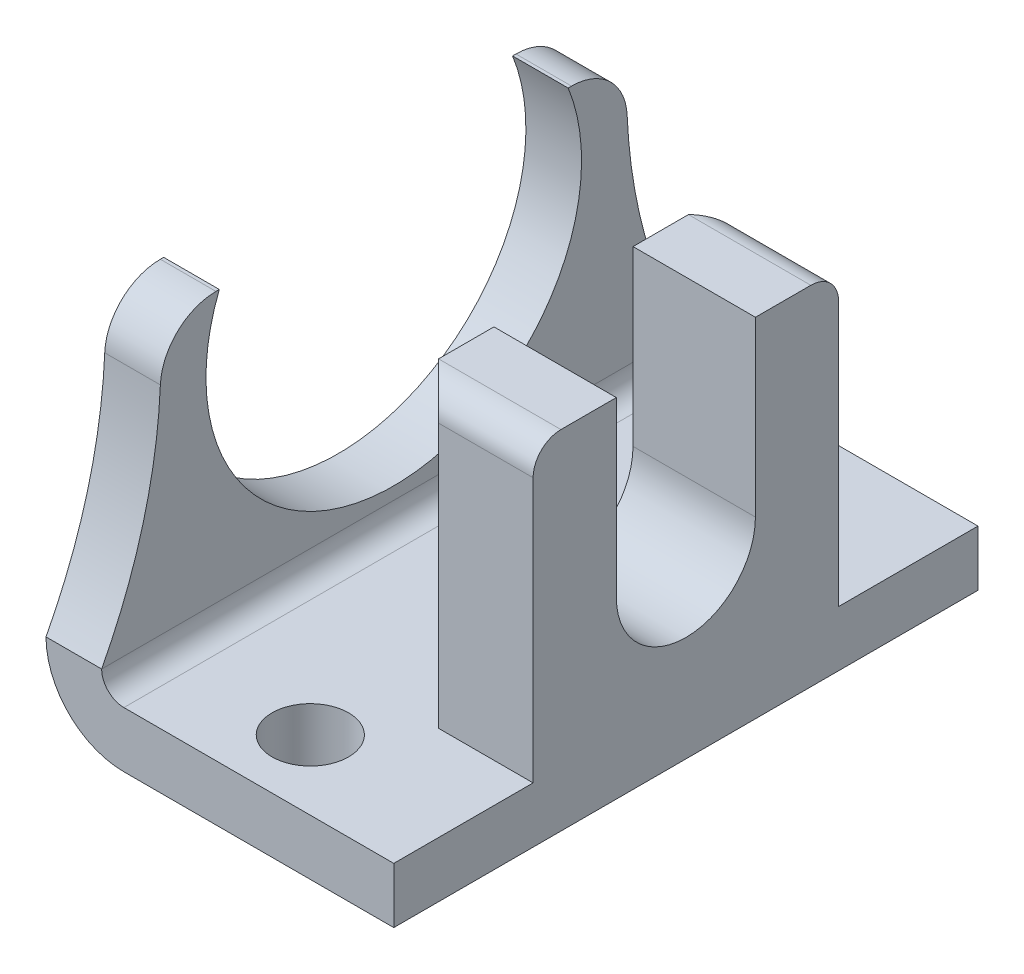
ISO-10303-21;
HEADER;
FILE_DESCRIPTION(('STEP AP214'),'2;1');
FILE_NAME('part.step','',(''),(''),'','','');
FILE_SCHEMA(('AUTOMOTIVE_DESIGN { 1 0 10303 214 1 1 1 1 }'));
ENDSEC;
DATA;
#1=APPLICATION_CONTEXT('core data for automotive mechanical design processes');
#2=APPLICATION_PROTOCOL_DEFINITION('international standard','automotive_design',2000,#1);
#3=PRODUCT_CONTEXT('',#1,'mechanical');
#4=PRODUCT('Part','Part','',(#3));
#5=PRODUCT_RELATED_PRODUCT_CATEGORY('part','',(#4));
#6=PRODUCT_DEFINITION_FORMATION('','',#4);
#7=PRODUCT_DEFINITION_CONTEXT('part definition',#1,'design');
#8=PRODUCT_DEFINITION('design','',#6,#7);
#9=PRODUCT_DEFINITION_SHAPE('','',#8);
#10=(LENGTH_UNIT() NAMED_UNIT(*) SI_UNIT(.MILLI.,.METRE.));
#11=(NAMED_UNIT(*) PLANE_ANGLE_UNIT() SI_UNIT($,.RADIAN.));
#12=(NAMED_UNIT(*) SI_UNIT($,.STERADIAN.) SOLID_ANGLE_UNIT());
#13=UNCERTAINTY_MEASURE_WITH_UNIT(LENGTH_MEASURE(1.E-05),#10,'distance_accuracy_value','');
#14=(GEOMETRIC_REPRESENTATION_CONTEXT(3) GLOBAL_UNCERTAINTY_ASSIGNED_CONTEXT((#13)) GLOBAL_UNIT_ASSIGNED_CONTEXT((#10,
#11,#12)) REPRESENTATION_CONTEXT('',''));
#15=CARTESIAN_POINT('',(0.,0.,0.));
#16=DIRECTION('',(0.,0.,1.));
#17=DIRECTION('',(1.,0.,0.));
#18=AXIS2_PLACEMENT_3D('',#15,#16,#17);
#19=CARTESIAN_POINT('',(0.,25.,-21.));
#20=DIRECTION('',(0.,1.,0.));
#21=DIRECTION('',(0.,0.,1.));
#22=AXIS2_PLACEMENT_3D('',#19,#20,#21);
#23=PLANE('',#22);
#24=DIRECTION('',(0.,0.,1.));
#25=VECTOR('',#24,1.);
#26=CARTESIAN_POINT('',(0.,25.,-21.));
#27=LINE('',#26,#25);
#28=CARTESIAN_POINT('',(0.,25.,12.5399362039845));
#29=VERTEX_POINT('',#28);
#30=CARTESIAN_POINT('',(0.,25.,12.7815482093835));
#31=VERTEX_POINT('',#30);
#32=EDGE_CURVE('E205',#29,#31,#27,.T.);
#33=ORIENTED_EDGE('',*,*,#32,.T.);
#34=DIRECTION('',(-1.,0.,0.));
#35=VECTOR('',#34,1.);
#36=CARTESIAN_POINT('',(4.,25.,12.7815482093835));
#37=LINE('',#36,#35);
#38=CARTESIAN_POINT('',(4.,25.,12.7815482093835));
#39=VERTEX_POINT('',#38);
#40=EDGE_CURVE('E369',#31,#39,#37,.F.);
#41=ORIENTED_EDGE('',*,*,#40,.T.);
#42=DIRECTION('',(0.,0.,1.));
#43=VECTOR('',#42,1.);
#44=CARTESIAN_POINT('',(4.,25.,-21.));
#45=LINE('',#44,#43);
#46=CARTESIAN_POINT('',(4.,25.,12.5399362039845));
#47=VERTEX_POINT('',#46);
#48=EDGE_CURVE('E298',#47,#39,#45,.T.);
#49=ORIENTED_EDGE('',*,*,#48,.F.);
#50=DIRECTION('',(1.,0.,0.));
#51=VECTOR('',#50,1.);
#52=CARTESIAN_POINT('',(4.,25.,12.5399362039845));
#53=LINE('',#52,#51);
#54=EDGE_CURVE('E214',#29,#47,#53,.T.);
#55=ORIENTED_EDGE('',*,*,#54,.F.);
#56=EDGE_LOOP('',(#33,#41,#49,#55));
#57=FACE_BOUND('',#56,.T.);
#58=ADVANCED_FACE('F39',(#57),#23,.T.);
#59=CARTESIAN_POINT('',(0.,25.,0.));
#60=DIRECTION('',(0.,-1.,0.));
#61=DIRECTION('',(0.,0.,-1.));
#62=AXIS2_PLACEMENT_3D('',#59,#60,#61);
#63=PLANE('',#62);
#64=DIRECTION('',(0.,0.,1.));
#65=VECTOR('',#64,1.);
#66=CARTESIAN_POINT('',(16.2,25.,10.9819738809373));
#67=LINE('',#66,#65);
#68=CARTESIAN_POINT('',(16.2,25.,5.));
#69=VERTEX_POINT('',#68);
#70=CARTESIAN_POINT('',(16.2,25.,8.98197388093732));
#71=VERTEX_POINT('',#70);
#72=EDGE_CURVE('E266',#69,#71,#67,.T.);
#73=ORIENTED_EDGE('',*,*,#72,.T.);
#74=DIRECTION('',(1.,0.,0.));
#75=VECTOR('',#74,1.);
#76=CARTESIAN_POINT('',(0.,25.,8.98197388093731));
#77=LINE('',#76,#75);
#78=CARTESIAN_POINT('',(25.,25.,8.9819738809373));
#79=VERTEX_POINT('',#78);
#80=EDGE_CURVE('E339',#71,#79,#77,.T.);
#81=ORIENTED_EDGE('',*,*,#80,.T.);
#82=DIRECTION('',(0.,0.,-1.));
#83=VECTOR('',#82,1.);
#84=CARTESIAN_POINT('',(25.,25.,-10.9819738809373));
#85=LINE('',#84,#83);
#86=CARTESIAN_POINT('',(25.,25.,5.));
#87=VERTEX_POINT('',#86);
#88=EDGE_CURVE('E267',#79,#87,#85,.T.);
#89=ORIENTED_EDGE('',*,*,#88,.T.);
#90=DIRECTION('',(1.,0.,0.));
#91=VECTOR('',#90,1.);
#92=CARTESIAN_POINT('',(-0.001000000000001,25.,5.));
#93=LINE('',#92,#91);
#94=EDGE_CURVE('E240',#69,#87,#93,.T.);
#95=ORIENTED_EDGE('',*,*,#94,.F.);
#96=EDGE_LOOP('',(#73,#81,#89,#95));
#97=FACE_BOUND('',#96,.T.);
#98=ADVANCED_FACE('F431',(#97),#63,.F.);
#99=CARTESIAN_POINT('',(4.,4.,-21.));
#100=DIRECTION('',(0.,-1.,0.));
#101=DIRECTION('',(0.,0.,-1.));
#102=AXIS2_PLACEMENT_3D('',#99,#100,#101);
#103=PLANE('',#102);
#104=CARTESIAN_POINT('',(14.,4.,16.));
#105=DIRECTION('',(0.,-1.,0.));
#106=DIRECTION('',(0.,0.,-1.));
#107=AXIS2_PLACEMENT_3D('',#104,#105,#106);
#108=CIRCLE('',#107,2.74999999999999);
#109=CARTESIAN_POINT('',(14.,4.,13.25));
#110=VERTEX_POINT('',#109);
#111=EDGE_CURVE('E513',#110,#110,#108,.T.);
#112=ORIENTED_EDGE('',*,*,#111,.T.);
#113=EDGE_LOOP('',(#112));
#114=FACE_BOUND('',#113,.T.);
#115=CARTESIAN_POINT('',(14.,4.,-16.));
#116=DIRECTION('',(0.,-1.,0.));
#117=DIRECTION('',(0.,0.,-1.));
#118=AXIS2_PLACEMENT_3D('',#115,#116,#117);
#119=CIRCLE('',#118,2.74999999999999);
#120=CARTESIAN_POINT('',(14.,4.,-18.75));
#121=VERTEX_POINT('',#120);
#122=EDGE_CURVE('E220',#121,#121,#119,.T.);
#123=ORIENTED_EDGE('',*,*,#122,.T.);
#124=EDGE_LOOP('',(#123));
#125=FACE_BOUND('',#124,.T.);
#126=DIRECTION('',(1.,0.,0.));
#127=VECTOR('',#126,1.);
#128=CARTESIAN_POINT('',(4.,4.,-21.));
#129=LINE('',#128,#127);
#130=CARTESIAN_POINT('',(5.59999999999992,4.,-21.));
#131=VERTEX_POINT('',#130);
#132=CARTESIAN_POINT('',(25.,4.,-21.));
#133=VERTEX_POINT('',#132);
#134=EDGE_CURVE('E291',#131,#133,#129,.T.);
#135=ORIENTED_EDGE('',*,*,#134,.F.);
#136=DIRECTION('',(0.,0.,1.));
#137=VECTOR('',#136,1.);
#138=CARTESIAN_POINT('',(5.59999999999992,4.,21.));
#139=LINE('',#138,#137);
#140=CARTESIAN_POINT('',(5.59999999999992,4.,21.));
#141=VERTEX_POINT('',#140);
#142=EDGE_CURVE('E329',#131,#141,#139,.T.);
#143=ORIENTED_EDGE('',*,*,#142,.T.);
#144=DIRECTION('',(1.,0.,0.));
#145=VECTOR('',#144,1.);
#146=CARTESIAN_POINT('',(4.,4.,21.));
#147=LINE('',#146,#145);
#148=CARTESIAN_POINT('',(25.,4.,21.));
#149=VERTEX_POINT('',#148);
#150=EDGE_CURVE('E290',#141,#149,#147,.T.);
#151=ORIENTED_EDGE('',*,*,#150,.T.);
#152=DIRECTION('',(0.,0.,1.));
#153=VECTOR('',#152,1.);
#154=CARTESIAN_POINT('',(25.,4.,-21.));
#155=LINE('',#154,#153);
#156=CARTESIAN_POINT('',(25.,4.,10.9819738809373));
#157=VERTEX_POINT('',#156);
#158=EDGE_CURVE('E293',#157,#149,#155,.T.);
#159=ORIENTED_EDGE('',*,*,#158,.F.);
#160=DIRECTION('',(1.,0.,0.));
#161=VECTOR('',#160,1.);
#162=CARTESIAN_POINT('',(25.,4.,10.9819738809373));
#163=LINE('',#162,#161);
#164=CARTESIAN_POINT('',(18.2,4.,10.9819738809373));
#165=VERTEX_POINT('',#164);
#166=EDGE_CURVE('E275',#165,#157,#163,.T.);
#167=ORIENTED_EDGE('',*,*,#166,.F.);
#168=DIRECTION('',(0.707106781186545,0.,0.70710678118655));
#169=VECTOR('',#168,1.);
#170=CARTESIAN_POINT('',(-4.89098694046862,4.,-12.1090130595314));
#171=LINE('',#170,#169);
#172=CARTESIAN_POINT('',(16.2,4.,8.98197388093732));
#173=VERTEX_POINT('',#172);
#174=EDGE_CURVE('E327',#165,#173,#171,.F.);
#175=ORIENTED_EDGE('',*,*,#174,.T.);
#176=DIRECTION('',(0.,0.,1.));
#177=VECTOR('',#176,1.);
#178=CARTESIAN_POINT('',(16.2,4.,10.9819738809373));
#179=LINE('',#178,#177);
#180=CARTESIAN_POINT('',(16.2,4.,-8.98197388093732));
#181=VERTEX_POINT('',#180);
#182=EDGE_CURVE('E272',#181,#173,#179,.T.);
#183=ORIENTED_EDGE('',*,*,#182,.F.);
#184=DIRECTION('',(-0.707106781186548,0.,0.707106781186547));
#185=VECTOR('',#184,1.);
#186=CARTESIAN_POINT('',(16.1090130595313,4.,-8.89098694046865));
#187=LINE('',#186,#185);
#188=CARTESIAN_POINT('',(18.2,4.,-10.9819738809373));
#189=VERTEX_POINT('',#188);
#190=EDGE_CURVE('E325',#181,#189,#187,.F.);
#191=ORIENTED_EDGE('',*,*,#190,.T.);
#192=DIRECTION('',(-1.,0.,0.));
#193=VECTOR('',#192,1.);
#194=CARTESIAN_POINT('',(16.2,4.,-10.9819738809373));
#195=LINE('',#194,#193);
#196=CARTESIAN_POINT('',(25.,4.,-10.9819738809373));
#197=VERTEX_POINT('',#196);
#198=EDGE_CURVE('E262',#197,#189,#195,.T.);
#199=ORIENTED_EDGE('',*,*,#198,.F.);
#200=EDGE_CURVE('E299',#133,#197,#155,.T.);
#201=ORIENTED_EDGE('',*,*,#200,.F.);
#202=EDGE_LOOP('',(#135,#143,#151,#159,#167,#175,#183,#191,#199,#201));
#203=FACE_BOUND('',#202,.T.);
#204=ADVANCED_FACE('F402',(#114,#125,#203),#103,.F.);
#205=CARTESIAN_POINT('',(0.,0.,21.));
#206=DIRECTION('',(0.,-1.,0.));
#207=DIRECTION('',(0.,0.,-1.));
#208=AXIS2_PLACEMENT_3D('',#205,#206,#207);
#209=PLANE('',#208);
#210=CARTESIAN_POINT('',(14.,0.,16.));
#211=DIRECTION('',(0.,-1.,0.));
#212=DIRECTION('',(0.,0.,-1.));
#213=AXIS2_PLACEMENT_3D('',#210,#211,#212);
#214=CIRCLE('',#213,2.74999999999999);
#215=CARTESIAN_POINT('',(14.,0.,13.25));
#216=VERTEX_POINT('',#215);
#217=EDGE_CURVE('E510',#216,#216,#214,.T.);
#218=ORIENTED_EDGE('',*,*,#217,.F.);
#219=EDGE_LOOP('',(#218));
#220=FACE_BOUND('',#219,.T.);
#221=CARTESIAN_POINT('',(14.,0.,-16.));
#222=DIRECTION('',(0.,-1.,0.));
#223=DIRECTION('',(0.,0.,-1.));
#224=AXIS2_PLACEMENT_3D('',#221,#222,#223);
#225=CIRCLE('',#224,2.74999999999999);
#226=CARTESIAN_POINT('',(14.,0.,-18.75));
#227=VERTEX_POINT('',#226);
#228=EDGE_CURVE('E223',#227,#227,#225,.T.);
#229=ORIENTED_EDGE('',*,*,#228,.F.);
#230=EDGE_LOOP('',(#229));
#231=FACE_BOUND('',#230,.T.);
#232=DIRECTION('',(1.,0.,0.));
#233=VECTOR('',#232,1.);
#234=CARTESIAN_POINT('',(0.,0.,21.));
#235=LINE('',#234,#233);
#236=CARTESIAN_POINT('',(5.59999999999989,0.,21.));
#237=VERTEX_POINT('',#236);
#238=CARTESIAN_POINT('',(25.,0.,21.));
#239=VERTEX_POINT('',#238);
#240=EDGE_CURVE('E310',#237,#239,#235,.T.);
#241=ORIENTED_EDGE('',*,*,#240,.F.);
#242=DIRECTION('',(0.,0.,-1.));
#243=VECTOR('',#242,1.);
#244=CARTESIAN_POINT('',(5.59999999999989,0.,-21.));
#245=LINE('',#244,#243);
#246=CARTESIAN_POINT('',(5.59999999999989,0.,-21.));
#247=VERTEX_POINT('',#246);
#248=EDGE_CURVE('E374',#237,#247,#245,.T.);
#249=ORIENTED_EDGE('',*,*,#248,.T.);
#250=DIRECTION('',(1.,0.,0.));
#251=VECTOR('',#250,1.);
#252=CARTESIAN_POINT('',(0.,0.,-21.));
#253=LINE('',#252,#251);
#254=CARTESIAN_POINT('',(25.,0.,-21.));
#255=VERTEX_POINT('',#254);
#256=EDGE_CURVE('E204',#247,#255,#253,.T.);
#257=ORIENTED_EDGE('',*,*,#256,.T.);
#258=DIRECTION('',(0.,0.,-1.));
#259=VECTOR('',#258,1.);
#260=CARTESIAN_POINT('',(25.,0.,21.));
#261=LINE('',#260,#259);
#262=EDGE_CURVE('E297',#239,#255,#261,.T.);
#263=ORIENTED_EDGE('',*,*,#262,.F.);
#264=EDGE_LOOP('',(#241,#249,#257,#263));
#265=FACE_BOUND('',#264,.T.);
#266=ADVANCED_FACE('F388',(#220,#231,#265),#209,.T.);
#267=CARTESIAN_POINT('',(0.,25.,21.));
#268=DIRECTION('',(0.,0.,1.));
#269=DIRECTION('',(0.,-1.,0.));
#270=AXIS2_PLACEMENT_3D('',#267,#268,#269);
#271=PLANE('',#270);
#272=DIRECTION('',(1.,0.,0.));
#273=VECTOR('',#272,1.);
#274=CARTESIAN_POINT('',(0.,5.6000000000005,21.));
#275=LINE('',#274,#273);
#276=CARTESIAN_POINT('',(0.,5.6000000000005,21.));
#277=VERTEX_POINT('',#276);
#278=CARTESIAN_POINT('',(4.,5.6000000000005,21.));
#279=VERTEX_POINT('',#278);
#280=EDGE_CURVE('E285',#277,#279,#275,.T.);
#281=ORIENTED_EDGE('',*,*,#280,.F.);
#282=CARTESIAN_POINT('',(5.59999999999989,5.59999999999989,21.));
#283=DIRECTION('',(0.,0.,1.));
#284=DIRECTION('',(0.,-1.,0.));
#285=AXIS2_PLACEMENT_3D('',#282,#283,#284);
#286=CIRCLE('',#285,5.59999999999989);
#287=EDGE_CURVE('E11',#277,#237,#286,.T.);
#288=ORIENTED_EDGE('',*,*,#287,.T.);
#289=ORIENTED_EDGE('',*,*,#240,.T.);
#290=DIRECTION('',(0.,-1.,0.));
#291=VECTOR('',#290,1.);
#292=CARTESIAN_POINT('',(25.,25.,21.));
#293=LINE('',#292,#291);
#294=EDGE_CURVE('E307',#149,#239,#293,.T.);
#295=ORIENTED_EDGE('',*,*,#294,.F.);
#296=ORIENTED_EDGE('',*,*,#150,.F.);
#297=CARTESIAN_POINT('',(5.59999999999992,5.59999999999992,21.));
#298=DIRECTION('',(0.,0.,1.));
#299=DIRECTION('',(0.,-1.,0.));
#300=AXIS2_PLACEMENT_3D('',#297,#298,#299);
#301=CIRCLE('',#300,1.59999999999992);
#302=EDGE_CURVE('E335',#141,#279,#301,.F.);
#303=ORIENTED_EDGE('',*,*,#302,.T.);
#304=EDGE_LOOP('',(#281,#288,#289,#295,#296,#303));
#305=FACE_BOUND('',#304,.T.);
#306=ADVANCED_FACE('F384',(#305),#271,.T.);
#307=CARTESIAN_POINT('',(4.,25.,-12.7815482093834));
#308=VERTEX_POINT('',#307);
#309=CARTESIAN_POINT('',(4.,25.,-12.5399362039845));
#310=VERTEX_POINT('',#309);
#311=EDGE_CURVE('E295',#308,#310,#45,.T.);
#312=ORIENTED_EDGE('',*,*,#311,.F.);
#313=DIRECTION('',(-1.,0.,0.));
#314=VECTOR('',#313,1.);
#315=CARTESIAN_POINT('',(0.,25.,-12.7815482093834));
#316=LINE('',#315,#314);
#317=CARTESIAN_POINT('',(0.,25.,-12.7815482093834));
#318=VERTEX_POINT('',#317);
#319=EDGE_CURVE('E200',#308,#318,#316,.T.);
#320=ORIENTED_EDGE('',*,*,#319,.T.);
#321=CARTESIAN_POINT('',(0.,25.,-12.5399362039845));
#322=VERTEX_POINT('',#321);
#323=EDGE_CURVE('E194',#318,#322,#27,.T.);
#324=ORIENTED_EDGE('',*,*,#323,.T.);
#325=DIRECTION('',(1.,0.,0.));
#326=VECTOR('',#325,1.);
#327=CARTESIAN_POINT('',(4.,25.,-12.5399362039845));
#328=LINE('',#327,#326);
#329=EDGE_CURVE('E198',#310,#322,#328,.F.);
#330=ORIENTED_EDGE('',*,*,#329,.F.);
#331=EDGE_LOOP('',(#312,#320,#324,#330));
#332=FACE_BOUND('',#331,.T.);
#333=ADVANCED_FACE('F197',(#332),#23,.T.);
#334=CARTESIAN_POINT('',(0.,0.,-21.));
#335=DIRECTION('',(0.,0.,-1.));
#336=DIRECTION('',(-1.,0.,0.));
#337=AXIS2_PLACEMENT_3D('',#334,#335,#336);
#338=PLANE('',#337);
#339=ORIENTED_EDGE('',*,*,#256,.F.);
#340=CARTESIAN_POINT('',(5.59999999999989,5.59999999999989,-21.));
#341=DIRECTION('',(0.,0.,-1.));
#342=DIRECTION('',(-1.,0.,0.));
#343=AXIS2_PLACEMENT_3D('',#340,#341,#342);
#344=CIRCLE('',#343,5.59999999999989);
#345=CARTESIAN_POINT('',(0.,5.60000000000006,-21.0000000000001));
#346=VERTEX_POINT('',#345);
#347=EDGE_CURVE('E54',#247,#346,#344,.T.);
#348=ORIENTED_EDGE('',*,*,#347,.T.);
#349=DIRECTION('',(1.,0.,0.));
#350=VECTOR('',#349,1.);
#351=CARTESIAN_POINT('',(0.,5.60000000000006,-21.0000000000001));
#352=LINE('',#351,#350);
#353=CARTESIAN_POINT('',(4.,5.60000000000006,-21.0000000000001));
#354=VERTEX_POINT('',#353);
#355=EDGE_CURVE('E232',#346,#354,#352,.T.);
#356=ORIENTED_EDGE('',*,*,#355,.T.);
#357=CARTESIAN_POINT('',(5.59999999999992,5.59999999999992,-21.));
#358=DIRECTION('',(0.,0.,-1.));
#359=DIRECTION('',(-1.,0.,0.));
#360=AXIS2_PLACEMENT_3D('',#357,#358,#359);
#361=CIRCLE('',#360,1.59999999999992);
#362=EDGE_CURVE('E337',#354,#131,#361,.F.);
#363=ORIENTED_EDGE('',*,*,#362,.T.);
#364=ORIENTED_EDGE('',*,*,#134,.T.);
#365=DIRECTION('',(0.,1.,0.));
#366=VECTOR('',#365,1.);
#367=CARTESIAN_POINT('',(25.,0.,-21.));
#368=LINE('',#367,#366);
#369=EDGE_CURVE('E304',#255,#133,#368,.T.);
#370=ORIENTED_EDGE('',*,*,#369,.F.);
#371=EDGE_LOOP('',(#339,#348,#356,#363,#364,#370));
#372=FACE_BOUND('',#371,.T.);
#373=ADVANCED_FACE('F392',(#372),#338,.T.);
#374=CARTESIAN_POINT('',(0.,0.,0.));
#375=DIRECTION('',(1.,0.,0.));
#376=DIRECTION('',(0.,0.,-1.));
#377=AXIS2_PLACEMENT_3D('',#374,#375,#376);
#378=PLANE('',#377);
#379=CARTESIAN_POINT('',(0.,22.7999999999999,-53.6093499231086));
#380=DIRECTION('',(1.,0.,0.));
#381=DIRECTION('',(0.,0.,-1.));
#382=AXIS2_PLACEMENT_3D('',#379,#380,#381);
#383=CIRCLE('',#382,36.8674612959413);
#384=CARTESIAN_POINT('',(0.,21.1761792822867,-16.7776664334219));
#385=VERTEX_POINT('',#384);
#386=EDGE_CURVE('E230',#385,#346,#383,.T.);
#387=ORIENTED_EDGE('',*,*,#386,.T.);
#388=DIRECTION('',(0.,0.,-1.));
#389=VECTOR('',#388,1.);
#390=CARTESIAN_POINT('',(0.,5.59999999999989,21.));
#391=LINE('',#390,#389);
#392=EDGE_CURVE('E47',#346,#277,#391,.F.);
#393=ORIENTED_EDGE('',*,*,#392,.T.);
#394=CARTESIAN_POINT('',(0.,22.7999999999999,53.6093499231086));
#395=DIRECTION('',(1.,0.,0.));
#396=DIRECTION('',(0.,0.,-1.));
#397=AXIS2_PLACEMENT_3D('',#394,#395,#396);
#398=CIRCLE('',#397,36.8674612959412);
#399=CARTESIAN_POINT('',(0.,21.1761792822867,16.7776664334221));
#400=VERTEX_POINT('',#399);
#401=EDGE_CURVE('E282',#277,#400,#398,.T.);
#402=ORIENTED_EDGE('',*,*,#401,.T.);
#403=CARTESIAN_POINT('',(0.,21.,12.7815482093835));
#404=DIRECTION('',(1.,0.,0.));
#405=DIRECTION('',(0.,0.,-1.));
#406=AXIS2_PLACEMENT_3D('',#403,#404,#405);
#407=CIRCLE('',#406,4.);
#408=EDGE_CURVE('E365',#400,#31,#407,.F.);
#409=ORIENTED_EDGE('',*,*,#408,.T.);
#410=ORIENTED_EDGE('',*,*,#32,.F.);
#411=CARTESIAN_POINT('',(0.,20.,0.));
#412=DIRECTION('',(1.,0.,0.));
#413=DIRECTION('',(0.,0.,-1.));
#414=AXIS2_PLACEMENT_3D('',#411,#412,#413);
#415=CIRCLE('',#414,13.5);
#416=EDGE_CURVE('E210',#29,#322,#415,.T.);
#417=ORIENTED_EDGE('',*,*,#416,.T.);
#418=ORIENTED_EDGE('',*,*,#323,.F.);
#419=CARTESIAN_POINT('',(0.,21.,-12.7815482093834));
#420=DIRECTION('',(1.,0.,0.));
#421=DIRECTION('',(0.,0.,-1.));
#422=AXIS2_PLACEMENT_3D('',#419,#420,#421);
#423=CIRCLE('',#422,4.);
#424=EDGE_CURVE('E367',#318,#385,#423,.F.);
#425=ORIENTED_EDGE('',*,*,#424,.T.);
#426=EDGE_LOOP('',(#387,#393,#402,#409,#410,#417,#418,#425));
#427=FACE_BOUND('',#426,.T.);
#428=ADVANCED_FACE('F218',(#427),#378,.F.);
#429=CARTESIAN_POINT('',(25.,0.,0.));
#430=DIRECTION('',(1.,0.,0.));
#431=DIRECTION('',(0.,0.,-1.));
#432=AXIS2_PLACEMENT_3D('',#429,#430,#431);
#433=PLANE('',#432);
#434=ORIENTED_EDGE('',*,*,#88,.F.);
#435=CARTESIAN_POINT('',(25.,23.,8.9819738809373));
#436=DIRECTION('',(1.,0.,0.));
#437=DIRECTION('',(0.,0.,-1.));
#438=AXIS2_PLACEMENT_3D('',#435,#436,#437);
#439=CIRCLE('',#438,2.);
#440=CARTESIAN_POINT('',(25.,23.,10.9819738809373));
#441=VERTEX_POINT('',#440);
#442=EDGE_CURVE('E344',#79,#441,#439,.T.);
#443=ORIENTED_EDGE('',*,*,#442,.T.);
#444=DIRECTION('',(0.,-1.,0.));
#445=VECTOR('',#444,1.);
#446=CARTESIAN_POINT('',(25.,25.,10.9819738809373));
#447=LINE('',#446,#445);
#448=EDGE_CURVE('E279',#441,#157,#447,.T.);
#449=ORIENTED_EDGE('',*,*,#448,.T.);
#450=ORIENTED_EDGE('',*,*,#158,.T.);
#451=ORIENTED_EDGE('',*,*,#294,.T.);
#452=ORIENTED_EDGE('',*,*,#262,.T.);
#453=ORIENTED_EDGE('',*,*,#369,.T.);
#454=ORIENTED_EDGE('',*,*,#200,.T.);
#455=DIRECTION('',(0.,-1.,0.));
#456=VECTOR('',#455,1.);
#457=CARTESIAN_POINT('',(25.,25.,-10.9819738809373));
#458=LINE('',#457,#456);
#459=CARTESIAN_POINT('',(25.,23.,-10.9819738809373));
#460=VERTEX_POINT('',#459);
#461=EDGE_CURVE('E269',#460,#197,#458,.T.);
#462=ORIENTED_EDGE('',*,*,#461,.F.);
#463=CARTESIAN_POINT('',(25.,23.,-8.9819738809373));
#464=DIRECTION('',(1.,0.,0.));
#465=DIRECTION('',(0.,0.,-1.));
#466=AXIS2_PLACEMENT_3D('',#463,#464,#465);
#467=CIRCLE('',#466,2.);
#468=CARTESIAN_POINT('',(25.,25.,-8.9819738809373));
#469=VERTEX_POINT('',#468);
#470=EDGE_CURVE('E342',#460,#469,#467,.T.);
#471=ORIENTED_EDGE('',*,*,#470,.T.);
#472=CARTESIAN_POINT('',(25.,25.,-5.));
#473=VERTEX_POINT('',#472);
#474=EDGE_CURVE('E265',#473,#469,#85,.T.);
#475=ORIENTED_EDGE('',*,*,#474,.F.);
#476=DIRECTION('',(0.,1.,0.));
#477=VECTOR('',#476,1.);
#478=CARTESIAN_POINT('',(25.,12.5604233888323,-5.));
#479=LINE('',#478,#477);
#480=CARTESIAN_POINT('',(25.,12.5604233888323,-5.));
#481=VERTEX_POINT('',#480);
#482=EDGE_CURVE('E244',#481,#473,#479,.T.);
#483=ORIENTED_EDGE('',*,*,#482,.F.);
#484=CARTESIAN_POINT('',(25.,12.5604233888323,0.));
#485=DIRECTION('',(1.,0.,0.));
#486=DIRECTION('',(0.,0.,-1.));
#487=AXIS2_PLACEMENT_3D('',#484,#485,#486);
#488=CIRCLE('',#487,5.);
#489=CARTESIAN_POINT('',(25.,12.5604233888323,5.));
#490=VERTEX_POINT('',#489);
#491=EDGE_CURVE('E237',#490,#481,#488,.T.);
#492=ORIENTED_EDGE('',*,*,#491,.F.);
#493=DIRECTION('',(0.,-1.,0.));
#494=VECTOR('',#493,1.);
#495=CARTESIAN_POINT('',(25.,25.,5.));
#496=LINE('',#495,#494);
#497=EDGE_CURVE('E241',#87,#490,#496,.T.);
#498=ORIENTED_EDGE('',*,*,#497,.F.);
#499=EDGE_LOOP('',(#434,#443,#449,#450,#451,#452,#453,#454,#462,#471,#475,#483,#492,#498));
#500=FACE_BOUND('',#499,.T.);
#501=ADVANCED_FACE('F397',(#500),#433,.T.);
#502=CARTESIAN_POINT('',(4.,25.,-21.));
#503=DIRECTION('',(-1.,0.,0.));
#504=DIRECTION('',(0.,0.,1.));
#505=AXIS2_PLACEMENT_3D('',#502,#503,#504);
#506=PLANE('',#505);
#507=CARTESIAN_POINT('',(4.,22.7999999999999,-53.6093499231086));
#508=DIRECTION('',(1.,0.,0.));
#509=DIRECTION('',(0.,0.,-1.));
#510=AXIS2_PLACEMENT_3D('',#507,#508,#509);
#511=CIRCLE('',#510,36.8674612959413);
#512=CARTESIAN_POINT('',(4.,21.1761792822867,-16.7776664334219));
#513=VERTEX_POINT('',#512);
#514=EDGE_CURVE('E229',#513,#354,#511,.T.);
#515=ORIENTED_EDGE('',*,*,#514,.F.);
#516=CARTESIAN_POINT('',(4.,21.,-12.7815482093834));
#517=DIRECTION('',(-1.,0.,0.));
#518=DIRECTION('',(0.,0.,1.));
#519=AXIS2_PLACEMENT_3D('',#516,#517,#518);
#520=CIRCLE('',#519,4.);
#521=EDGE_CURVE('E362',#513,#308,#520,.F.);
#522=ORIENTED_EDGE('',*,*,#521,.T.);
#523=ORIENTED_EDGE('',*,*,#311,.T.);
#524=CARTESIAN_POINT('',(4.,20.,0.));
#525=DIRECTION('',(-1.,0.,0.));
#526=DIRECTION('',(0.,0.,1.));
#527=AXIS2_PLACEMENT_3D('',#524,#525,#526);
#528=CIRCLE('',#527,13.5);
#529=EDGE_CURVE('E213',#310,#47,#528,.T.);
#530=ORIENTED_EDGE('',*,*,#529,.T.);
#531=ORIENTED_EDGE('',*,*,#48,.T.);
#532=CARTESIAN_POINT('',(4.,21.,12.7815482093835));
#533=DIRECTION('',(-1.,0.,0.));
#534=DIRECTION('',(0.,0.,1.));
#535=AXIS2_PLACEMENT_3D('',#532,#533,#534);
#536=CIRCLE('',#535,4.);
#537=CARTESIAN_POINT('',(4.,21.1761792822867,16.7776664334221));
#538=VERTEX_POINT('',#537);
#539=EDGE_CURVE('E360',#39,#538,#536,.F.);
#540=ORIENTED_EDGE('',*,*,#539,.T.);
#541=CARTESIAN_POINT('',(4.,22.7999999999999,53.6093499231086));
#542=DIRECTION('',(1.,0.,0.));
#543=DIRECTION('',(0.,0.,-1.));
#544=AXIS2_PLACEMENT_3D('',#541,#542,#543);
#545=CIRCLE('',#544,36.8674612959412);
#546=EDGE_CURVE('E281',#279,#538,#545,.T.);
#547=ORIENTED_EDGE('',*,*,#546,.F.);
#548=DIRECTION('',(0.,0.,1.));
#549=VECTOR('',#548,1.);
#550=CARTESIAN_POINT('',(4.,5.59999999999992,-21.));
#551=LINE('',#550,#549);
#552=EDGE_CURVE('E332',#279,#354,#551,.F.);
#553=ORIENTED_EDGE('',*,*,#552,.T.);
#554=EDGE_LOOP('',(#515,#522,#523,#530,#531,#540,#547,#553));
#555=FACE_BOUND('',#554,.T.);
#556=ADVANCED_FACE('F411',(#555),#506,.F.);
#557=CARTESIAN_POINT('',(0.,22.7999999999999,53.6093499231086));
#558=DIRECTION('',(1.,0.,0.));
#559=DIRECTION('',(0.,0.,-1.));
#560=AXIS2_PLACEMENT_3D('',#557,#558,#559);
#561=CYLINDRICAL_SURFACE('',#560,36.8674612959412);
#562=ORIENTED_EDGE('',*,*,#546,.T.);
#563=DIRECTION('',(1.,0.,0.));
#564=VECTOR('',#563,1.);
#565=CARTESIAN_POINT('',(0.,21.1761792822867,16.7776664334221));
#566=LINE('',#565,#564);
#567=EDGE_CURVE('E372',#538,#400,#566,.F.);
#568=ORIENTED_EDGE('',*,*,#567,.T.);
#569=ORIENTED_EDGE('',*,*,#401,.F.);
#570=ORIENTED_EDGE('',*,*,#280,.T.);
#571=EDGE_LOOP('',(#562,#568,#569,#570));
#572=FACE_BOUND('',#571,.T.);
#573=ADVANCED_FACE('F381',(#572),#561,.F.);
#574=CARTESIAN_POINT('',(16.2,25.,-10.9819738809373));
#575=DIRECTION('',(0.,0.,1.));
#576=DIRECTION('',(1.,0.,0.));
#577=AXIS2_PLACEMENT_3D('',#574,#575,#576);
#578=PLANE('',#577);
#579=DIRECTION('',(0.,1.,0.));
#580=VECTOR('',#579,1.);
#581=CARTESIAN_POINT('',(18.2,25.,-10.9819738809373));
#582=LINE('',#581,#580);
#583=CARTESIAN_POINT('',(18.2,23.,-10.9819738809373));
#584=VERTEX_POINT('',#583);
#585=EDGE_CURVE('E320',#189,#584,#582,.T.);
#586=ORIENTED_EDGE('',*,*,#585,.T.);
#587=DIRECTION('',(-1.,0.,0.));
#588=VECTOR('',#587,1.);
#589=CARTESIAN_POINT('',(16.2,23.,-10.9819738809373));
#590=LINE('',#589,#588);
#591=EDGE_CURVE('E355',#584,#460,#590,.F.);
#592=ORIENTED_EDGE('',*,*,#591,.T.);
#593=ORIENTED_EDGE('',*,*,#461,.T.);
#594=ORIENTED_EDGE('',*,*,#198,.T.);
#595=EDGE_LOOP('',(#586,#592,#593,#594));
#596=FACE_BOUND('',#595,.T.);
#597=ADVANCED_FACE('F463',(#596),#578,.F.);
#598=CARTESIAN_POINT('',(16.2,25.,10.9819738809373));
#599=DIRECTION('',(1.,0.,0.));
#600=DIRECTION('',(0.,0.,-1.));
#601=AXIS2_PLACEMENT_3D('',#598,#599,#600);
#602=PLANE('',#601);
#603=CARTESIAN_POINT('',(16.2,25.,-8.98197388093732));
#604=VERTEX_POINT('',#603);
#605=CARTESIAN_POINT('',(16.2,25.,-5.));
#606=VERTEX_POINT('',#605);
#607=EDGE_CURVE('E263',#604,#606,#67,.T.);
#608=ORIENTED_EDGE('',*,*,#607,.F.);
#609=DIRECTION('',(0.,-1.,0.));
#610=VECTOR('',#609,1.);
#611=CARTESIAN_POINT('',(16.2,25.,-8.98197388093732));
#612=LINE('',#611,#610);
#613=EDGE_CURVE('E317',#604,#181,#612,.T.);
#614=ORIENTED_EDGE('',*,*,#613,.T.);
#615=ORIENTED_EDGE('',*,*,#182,.T.);
#616=DIRECTION('',(0.,1.,0.));
#617=VECTOR('',#616,1.);
#618=CARTESIAN_POINT('',(16.2,25.,8.98197388093732));
#619=LINE('',#618,#617);
#620=EDGE_CURVE('E313',#173,#71,#619,.T.);
#621=ORIENTED_EDGE('',*,*,#620,.T.);
#622=ORIENTED_EDGE('',*,*,#72,.F.);
#623=DIRECTION('',(0.,1.,0.));
#624=VECTOR('',#623,1.);
#625=CARTESIAN_POINT('',(16.2,25.,5.));
#626=LINE('',#625,#624);
#627=CARTESIAN_POINT('',(16.2,12.5604233888323,5.));
#628=VERTEX_POINT('',#627);
#629=EDGE_CURVE('E246',#628,#69,#626,.T.);
#630=ORIENTED_EDGE('',*,*,#629,.F.);
#631=CARTESIAN_POINT('',(16.2,12.5604233888323,0.));
#632=DIRECTION('',(1.,0.,0.));
#633=DIRECTION('',(0.,0.,-1.));
#634=AXIS2_PLACEMENT_3D('',#631,#632,#633);
#635=CIRCLE('',#634,5.);
#636=CARTESIAN_POINT('',(16.2,12.5604233888323,-5.));
#637=VERTEX_POINT('',#636);
#638=EDGE_CURVE('E249',#637,#628,#635,.F.);
#639=ORIENTED_EDGE('',*,*,#638,.F.);
#640=DIRECTION('',(0.,-1.,0.));
#641=VECTOR('',#640,1.);
#642=CARTESIAN_POINT('',(16.2,12.5604233888323,-5.));
#643=LINE('',#642,#641);
#644=EDGE_CURVE('E236',#606,#637,#643,.T.);
#645=ORIENTED_EDGE('',*,*,#644,.F.);
#646=EDGE_LOOP('',(#608,#614,#615,#621,#622,#630,#639,#645));
#647=FACE_BOUND('',#646,.T.);
#648=ADVANCED_FACE('F466',(#647),#602,.F.);
#649=CARTESIAN_POINT('',(25.,25.,10.9819738809373));
#650=DIRECTION('',(0.,0.,-1.));
#651=DIRECTION('',(-1.,0.,0.));
#652=AXIS2_PLACEMENT_3D('',#649,#650,#651);
#653=PLANE('',#652);
#654=ORIENTED_EDGE('',*,*,#448,.F.);
#655=DIRECTION('',(1.,0.,0.));
#656=VECTOR('',#655,1.);
#657=CARTESIAN_POINT('',(25.,23.,10.9819738809373));
#658=LINE('',#657,#656);
#659=CARTESIAN_POINT('',(18.2,23.,10.9819738809373));
#660=VERTEX_POINT('',#659);
#661=EDGE_CURVE('E346',#441,#660,#658,.F.);
#662=ORIENTED_EDGE('',*,*,#661,.T.);
#663=DIRECTION('',(0.,-1.,0.));
#664=VECTOR('',#663,1.);
#665=CARTESIAN_POINT('',(18.2,25.,10.9819738809373));
#666=LINE('',#665,#664);
#667=EDGE_CURVE('E323',#660,#165,#666,.T.);
#668=ORIENTED_EDGE('',*,*,#667,.T.);
#669=ORIENTED_EDGE('',*,*,#166,.T.);
#670=EDGE_LOOP('',(#654,#662,#668,#669));
#671=FACE_BOUND('',#670,.T.);
#672=ADVANCED_FACE('F470',(#671),#653,.F.);
#673=ORIENTED_EDGE('',*,*,#474,.T.);
#674=DIRECTION('',(-1.,0.,0.));
#675=VECTOR('',#674,1.);
#676=CARTESIAN_POINT('',(0.,25.,-8.9819738809373));
#677=LINE('',#676,#675);
#678=EDGE_CURVE('E350',#469,#604,#677,.T.);
#679=ORIENTED_EDGE('',*,*,#678,.T.);
#680=ORIENTED_EDGE('',*,*,#607,.T.);
#681=DIRECTION('',(1.,0.,0.));
#682=VECTOR('',#681,1.);
#683=CARTESIAN_POINT('',(-0.001000000000001,25.,-5.));
#684=LINE('',#683,#682);
#685=EDGE_CURVE('E255',#606,#473,#684,.T.);
#686=ORIENTED_EDGE('',*,*,#685,.T.);
#687=EDGE_LOOP('',(#673,#679,#680,#686));
#688=FACE_BOUND('',#687,.T.);
#689=ADVANCED_FACE('F438',(#688),#63,.F.);
#690=CARTESIAN_POINT('',(-0.001000000000001,25.,5.));
#691=DIRECTION('',(0.,0.,1.));
#692=DIRECTION('',(1.,0.,0.));
#693=AXIS2_PLACEMENT_3D('',#690,#691,#692);
#694=PLANE('',#693);
#695=ORIENTED_EDGE('',*,*,#629,.T.);
#696=ORIENTED_EDGE('',*,*,#94,.T.);
#697=ORIENTED_EDGE('',*,*,#497,.T.);
#698=DIRECTION('',(1.,0.,0.));
#699=VECTOR('',#698,1.);
#700=CARTESIAN_POINT('',(-0.001000000000001,12.5604233888323,5.));
#701=LINE('',#700,#699);
#702=EDGE_CURVE('E256',#628,#490,#701,.T.);
#703=ORIENTED_EDGE('',*,*,#702,.F.);
#704=EDGE_LOOP('',(#695,#696,#697,#703));
#705=FACE_BOUND('',#704,.T.);
#706=ADVANCED_FACE('F476',(#705),#694,.F.);
#707=CARTESIAN_POINT('',(-0.001000000000001,12.5604233888323,0.));
#708=DIRECTION('',(1.,0.,0.));
#709=DIRECTION('',(0.,0.,-1.));
#710=AXIS2_PLACEMENT_3D('',#707,#708,#709);
#711=CYLINDRICAL_SURFACE('',#710,5.);
#712=ORIENTED_EDGE('',*,*,#638,.T.);
#713=ORIENTED_EDGE('',*,*,#702,.T.);
#714=ORIENTED_EDGE('',*,*,#491,.T.);
#715=DIRECTION('',(1.,0.,0.));
#716=VECTOR('',#715,1.);
#717=CARTESIAN_POINT('',(-0.001000000000001,12.5604233888323,-5.));
#718=LINE('',#717,#716);
#719=EDGE_CURVE('E253',#637,#481,#718,.T.);
#720=ORIENTED_EDGE('',*,*,#719,.F.);
#721=EDGE_LOOP('',(#712,#713,#714,#720));
#722=FACE_BOUND('',#721,.T.);
#723=ADVANCED_FACE('F480',(#722),#711,.F.);
#724=CARTESIAN_POINT('',(-0.001000000000001,12.5604233888323,-5.));
#725=DIRECTION('',(0.,0.,-1.));
#726=DIRECTION('',(-1.,0.,0.));
#727=AXIS2_PLACEMENT_3D('',#724,#725,#726);
#728=PLANE('',#727);
#729=ORIENTED_EDGE('',*,*,#644,.T.);
#730=ORIENTED_EDGE('',*,*,#719,.T.);
#731=ORIENTED_EDGE('',*,*,#482,.T.);
#732=ORIENTED_EDGE('',*,*,#685,.F.);
#733=EDGE_LOOP('',(#729,#730,#731,#732));
#734=FACE_BOUND('',#733,.T.);
#735=ADVANCED_FACE('F484',(#734),#728,.F.);
#736=CARTESIAN_POINT('',(0.,22.7999999999999,-53.6093499231086));
#737=DIRECTION('',(1.,0.,0.));
#738=DIRECTION('',(0.,0.,-1.));
#739=AXIS2_PLACEMENT_3D('',#736,#737,#738);
#740=CYLINDRICAL_SURFACE('',#739,36.8674612959413);
#741=ORIENTED_EDGE('',*,*,#386,.F.);
#742=DIRECTION('',(1.,0.,0.));
#743=VECTOR('',#742,1.);
#744=CARTESIAN_POINT('',(0.,21.1761792822867,-16.7776664334219));
#745=LINE('',#744,#743);
#746=EDGE_CURVE('E357',#385,#513,#745,.T.);
#747=ORIENTED_EDGE('',*,*,#746,.T.);
#748=ORIENTED_EDGE('',*,*,#514,.T.);
#749=ORIENTED_EDGE('',*,*,#355,.F.);
#750=EDGE_LOOP('',(#741,#747,#748,#749));
#751=FACE_BOUND('',#750,.T.);
#752=ADVANCED_FACE('F413',(#751),#740,.F.);
#753=CARTESIAN_POINT('',(4.,20.,0.));
#754=DIRECTION('',(1.,0.,0.));
#755=DIRECTION('',(0.,0.,-1.));
#756=AXIS2_PLACEMENT_3D('',#753,#754,#755);
#757=CYLINDRICAL_SURFACE('',#756,13.5);
#758=ORIENTED_EDGE('',*,*,#54,.T.);
#759=ORIENTED_EDGE('',*,*,#529,.F.);
#760=ORIENTED_EDGE('',*,*,#329,.T.);
#761=ORIENTED_EDGE('',*,*,#416,.F.);
#762=EDGE_LOOP('',(#758,#759,#760,#761));
#763=FACE_BOUND('',#762,.T.);
#764=ADVANCED_FACE('F209',(#763),#757,.F.);
#765=CARTESIAN_POINT('',(14.,0.,-16.));
#766=DIRECTION('',(0.,-1.,0.));
#767=DIRECTION('',(0.,0.,-1.));
#768=AXIS2_PLACEMENT_3D('',#765,#766,#767);
#769=CYLINDRICAL_SURFACE('',#768,2.74999999999999);
#770=ORIENTED_EDGE('',*,*,#228,.T.);
#771=EDGE_LOOP('',(#770));
#772=FACE_BOUND('',#771,.T.);
#773=ORIENTED_EDGE('',*,*,#122,.F.);
#774=EDGE_LOOP('',(#773));
#775=FACE_BOUND('',#774,.T.);
#776=ADVANCED_FACE('F493',(#772,#775),#769,.F.);
#777=CARTESIAN_POINT('',(14.,0.,16.));
#778=DIRECTION('',(0.,-1.,0.));
#779=DIRECTION('',(0.,0.,-1.));
#780=AXIS2_PLACEMENT_3D('',#777,#778,#779);
#781=CYLINDRICAL_SURFACE('',#780,2.74999999999999);
#782=ORIENTED_EDGE('',*,*,#217,.T.);
#783=EDGE_LOOP('',(#782));
#784=FACE_BOUND('',#783,.T.);
#785=ORIENTED_EDGE('',*,*,#111,.F.);
#786=EDGE_LOOP('',(#785));
#787=FACE_BOUND('',#786,.T.);
#788=ADVANCED_FACE('F496',(#784,#787),#781,.F.);
#789=CARTESIAN_POINT('',(16.2,25.,-8.98197388093732));
#790=DIRECTION('',(0.707106781186547,0.,0.707106781186548));
#791=DIRECTION('',(0.,-1.,0.));
#792=AXIS2_PLACEMENT_3D('',#789,#790,#791);
#793=PLANE('',#792);
#794=ORIENTED_EDGE('',*,*,#613,.F.);
#795=CARTESIAN_POINT('',(16.2,23.,-8.9819738809373));
#796=DIRECTION('',(0.707106781186547,0.,0.707106781186548));
#797=DIRECTION('',(-0.707106781186548,0.,0.707106781186547));
#798=AXIS2_PLACEMENT_3D('',#795,#796,#797);
#799=ELLIPSE('',#798,2.82842712474619,2.);
#800=EDGE_CURVE('E353',#604,#584,#799,.F.);
#801=ORIENTED_EDGE('',*,*,#800,.T.);
#802=ORIENTED_EDGE('',*,*,#585,.F.);
#803=ORIENTED_EDGE('',*,*,#190,.F.);
#804=EDGE_LOOP('',(#794,#801,#802,#803));
#805=FACE_BOUND('',#804,.T.);
#806=ADVANCED_FACE('F499',(#805),#793,.F.);
#807=CARTESIAN_POINT('',(18.2,25.,10.9819738809373));
#808=DIRECTION('',(0.70710678118655,0.,-0.707106781186545));
#809=DIRECTION('',(0.,-1.,0.));
#810=AXIS2_PLACEMENT_3D('',#807,#808,#809);
#811=PLANE('',#810);
#812=ORIENTED_EDGE('',*,*,#667,.F.);
#813=CARTESIAN_POINT('',(16.2,23.,8.9819738809373));
#814=DIRECTION('',(0.70710678118655,0.,-0.707106781186545));
#815=DIRECTION('',(0.707106781186545,0.,0.70710678118655));
#816=AXIS2_PLACEMENT_3D('',#813,#814,#815);
#817=ELLIPSE('',#816,2.82842712474618,2.);
#818=EDGE_CURVE('E348',#660,#71,#817,.F.);
#819=ORIENTED_EDGE('',*,*,#818,.T.);
#820=ORIENTED_EDGE('',*,*,#620,.F.);
#821=ORIENTED_EDGE('',*,*,#174,.F.);
#822=EDGE_LOOP('',(#812,#819,#820,#821));
#823=FACE_BOUND('',#822,.T.);
#824=ADVANCED_FACE('F504',(#823),#811,.F.);
#825=CARTESIAN_POINT('',(5.59999999999992,5.59999999999992,-21.));
#826=DIRECTION('',(0.,0.,-1.));
#827=DIRECTION('',(-1.,0.,0.));
#828=AXIS2_PLACEMENT_3D('',#825,#826,#827);
#829=CYLINDRICAL_SURFACE('',#828,1.59999999999992);
#830=ORIENTED_EDGE('',*,*,#362,.F.);
#831=ORIENTED_EDGE('',*,*,#552,.F.);
#832=ORIENTED_EDGE('',*,*,#302,.F.);
#833=ORIENTED_EDGE('',*,*,#142,.F.);
#834=EDGE_LOOP('',(#830,#831,#832,#833));
#835=FACE_BOUND('',#834,.T.);
#836=ADVANCED_FACE('F407',(#835),#829,.F.);
#837=CARTESIAN_POINT('',(0.,23.,8.98197388093731));
#838=DIRECTION('',(1.,0.,0.));
#839=DIRECTION('',(0.,0.,-1.));
#840=AXIS2_PLACEMENT_3D('',#837,#838,#839);
#841=CYLINDRICAL_SURFACE('',#840,2.);
#842=ORIENTED_EDGE('',*,*,#818,.F.);
#843=ORIENTED_EDGE('',*,*,#661,.F.);
#844=ORIENTED_EDGE('',*,*,#442,.F.);
#845=ORIENTED_EDGE('',*,*,#80,.F.);
#846=EDGE_LOOP('',(#842,#843,#844,#845));
#847=FACE_BOUND('',#846,.T.);
#848=ADVANCED_FACE('F536',(#847),#841,.T.);
#849=CARTESIAN_POINT('',(0.,23.,-8.9819738809373));
#850=DIRECTION('',(-1.,0.,0.));
#851=DIRECTION('',(0.,0.,1.));
#852=AXIS2_PLACEMENT_3D('',#849,#850,#851);
#853=CYLINDRICAL_SURFACE('',#852,2.);
#854=ORIENTED_EDGE('',*,*,#470,.F.);
#855=ORIENTED_EDGE('',*,*,#591,.F.);
#856=ORIENTED_EDGE('',*,*,#800,.F.);
#857=ORIENTED_EDGE('',*,*,#678,.F.);
#858=EDGE_LOOP('',(#854,#855,#856,#857));
#859=FACE_BOUND('',#858,.T.);
#860=ADVANCED_FACE('F428',(#859),#853,.T.);
#861=CARTESIAN_POINT('',(0.,21.,-12.7815482093834));
#862=DIRECTION('',(1.,0.,0.));
#863=DIRECTION('',(0.,0.,-1.));
#864=AXIS2_PLACEMENT_3D('',#861,#862,#863);
#865=CYLINDRICAL_SURFACE('',#864,4.);
#866=ORIENTED_EDGE('',*,*,#424,.F.);
#867=ORIENTED_EDGE('',*,*,#319,.F.);
#868=ORIENTED_EDGE('',*,*,#521,.F.);
#869=ORIENTED_EDGE('',*,*,#746,.F.);
#870=EDGE_LOOP('',(#866,#867,#868,#869));
#871=FACE_BOUND('',#870,.T.);
#872=ADVANCED_FACE('F416',(#871),#865,.T.);
#873=CARTESIAN_POINT('',(0.,21.,12.7815482093835));
#874=DIRECTION('',(1.,0.,0.));
#875=DIRECTION('',(0.,0.,-1.));
#876=AXIS2_PLACEMENT_3D('',#873,#874,#875);
#877=CYLINDRICAL_SURFACE('',#876,4.);
#878=ORIENTED_EDGE('',*,*,#408,.F.);
#879=ORIENTED_EDGE('',*,*,#567,.F.);
#880=ORIENTED_EDGE('',*,*,#539,.F.);
#881=ORIENTED_EDGE('',*,*,#40,.F.);
#882=EDGE_LOOP('',(#878,#879,#880,#881));
#883=FACE_BOUND('',#882,.T.);
#884=ADVANCED_FACE('F422',(#883),#877,.T.);
#885=CARTESIAN_POINT('',(5.59999999999989,5.59999999999989,21.));
#886=DIRECTION('',(0.,0.,1.));
#887=DIRECTION('',(1.,0.,0.));
#888=AXIS2_PLACEMENT_3D('',#885,#886,#887);
#889=CYLINDRICAL_SURFACE('',#888,5.59999999999989);
#890=ORIENTED_EDGE('',*,*,#287,.F.);
#891=ORIENTED_EDGE('',*,*,#392,.F.);
#892=ORIENTED_EDGE('',*,*,#347,.F.);
#893=ORIENTED_EDGE('',*,*,#248,.F.);
#894=EDGE_LOOP('',(#890,#891,#892,#893));
#895=FACE_BOUND('',#894,.T.);
#896=ADVANCED_FACE('F41',(#895),#889,.T.);
#897=CLOSED_SHELL('',(#58,#98,#204,#266,#306,#333,#373,#428,#501,#556,#573,#597,#648,#672,#689,
#706,#723,#735,#752,#764,#776,#788,#806,#824,#836,#848,#860,#872,#884,#896));
#898=MANIFOLD_SOLID_BREP('B2',#897);
#899=ADVANCED_BREP_SHAPE_REPRESENTATION('',(#18,#898),#14);
#900=SHAPE_DEFINITION_REPRESENTATION(#9,#899);
ENDSEC;
END-ISO-10303-21;
